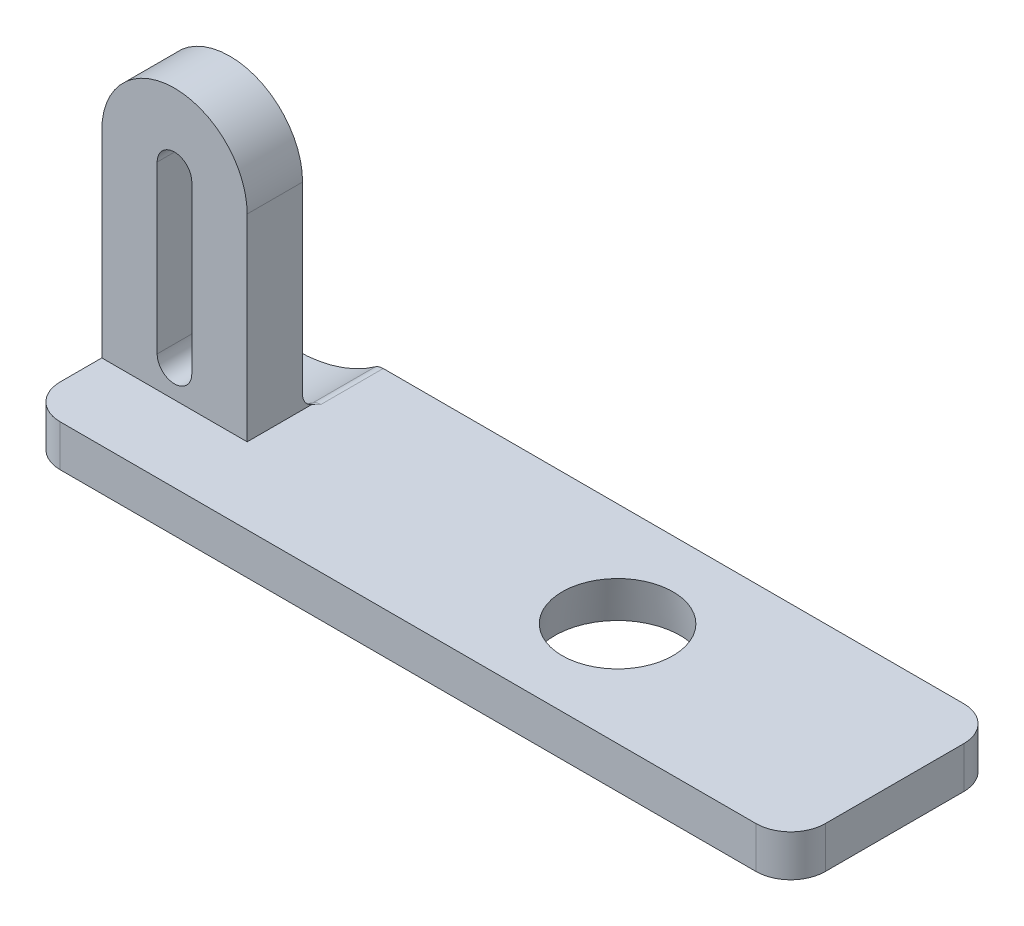
ISO-10303-21;
HEADER;
FILE_DESCRIPTION(('STEP AP214'),'2;1');
FILE_NAME('part.step','',(''),(''),'','','');
FILE_SCHEMA(('AUTOMOTIVE_DESIGN { 1 0 10303 214 1 1 1 1 }'));
ENDSEC;
DATA;
#1=APPLICATION_CONTEXT('core data for automotive mechanical design processes');
#2=APPLICATION_PROTOCOL_DEFINITION('international standard','automotive_design',2000,#1);
#3=PRODUCT_CONTEXT('',#1,'mechanical');
#4=PRODUCT('Part','Part','',(#3));
#5=PRODUCT_RELATED_PRODUCT_CATEGORY('part','',(#4));
#6=PRODUCT_DEFINITION_FORMATION('','',#4);
#7=PRODUCT_DEFINITION_CONTEXT('part definition',#1,'design');
#8=PRODUCT_DEFINITION('design','',#6,#7);
#9=PRODUCT_DEFINITION_SHAPE('','',#8);
#10=(LENGTH_UNIT() NAMED_UNIT(*) SI_UNIT(.MILLI.,.METRE.));
#11=(NAMED_UNIT(*) PLANE_ANGLE_UNIT() SI_UNIT($,.RADIAN.));
#12=(NAMED_UNIT(*) SI_UNIT($,.STERADIAN.) SOLID_ANGLE_UNIT());
#13=UNCERTAINTY_MEASURE_WITH_UNIT(LENGTH_MEASURE(1.E-05),#10,'distance_accuracy_value','');
#14=(GEOMETRIC_REPRESENTATION_CONTEXT(3) GLOBAL_UNCERTAINTY_ASSIGNED_CONTEXT((#13)) GLOBAL_UNIT_ASSIGNED_CONTEXT((#10,
#11,#12)) REPRESENTATION_CONTEXT('',''));
#15=CARTESIAN_POINT('',(0.,0.,0.));
#16=DIRECTION('',(0.,0.,1.));
#17=DIRECTION('',(1.,0.,0.));
#18=AXIS2_PLACEMENT_3D('',#15,#16,#17);
#19=CARTESIAN_POINT('',(-2.75,12.,-5.));
#20=DIRECTION('',(0.,1.,0.));
#21=DIRECTION('',(0.,0.,1.));
#22=AXIS2_PLACEMENT_3D('',#19,#20,#21);
#23=CYLINDRICAL_SURFACE('',#22,2.5);
#24=DIRECTION('',(0.,-1.,0.));
#25=VECTOR('',#24,1.);
#26=CARTESIAN_POINT('',(-5.25,-5.25,-5.));
#27=LINE('',#26,#25);
#28=CARTESIAN_POINT('',(-5.25,-4.25,-5.));
#29=VERTEX_POINT('',#28);
#30=CARTESIAN_POINT('',(-5.25,-5.25,-5.));
#31=VERTEX_POINT('',#30);
#32=EDGE_CURVE('E194',#29,#31,#27,.T.);
#33=ORIENTED_EDGE('',*,*,#32,.F.);
#34=CARTESIAN_POINT('',(-2.75,-4.25,-5.));
#35=DIRECTION('',(0.,1.,0.));
#36=DIRECTION('',(0.,0.,1.));
#37=AXIS2_PLACEMENT_3D('',#34,#35,#36);
#38=CIRCLE('',#37,2.5);
#39=CARTESIAN_POINT('',(-2.75,-4.25,-7.5));
#40=VERTEX_POINT('',#39);
#41=EDGE_CURVE('E181',#40,#29,#38,.T.);
#42=ORIENTED_EDGE('',*,*,#41,.F.);
#43=DIRECTION('',(0.,-1.,0.));
#44=VECTOR('',#43,1.);
#45=CARTESIAN_POINT('',(-2.75,-2.25,-7.5));
#46=LINE('',#45,#44);
#47=CARTESIAN_POINT('',(-2.75,-5.25,-7.5));
#48=VERTEX_POINT('',#47);
#49=EDGE_CURVE('E215',#48,#40,#46,.F.);
#50=ORIENTED_EDGE('',*,*,#49,.F.);
#51=CARTESIAN_POINT('',(-2.75,-5.25,-5.));
#52=DIRECTION('',(0.,1.,0.));
#53=DIRECTION('',(0.,0.,1.));
#54=AXIS2_PLACEMENT_3D('',#51,#52,#53);
#55=CIRCLE('',#54,2.5);
#56=EDGE_CURVE('E198',#31,#48,#55,.F.);
#57=ORIENTED_EDGE('',*,*,#56,.F.);
#58=EDGE_LOOP('',(#33,#42,#50,#57));
#59=FACE_BOUND('',#58,.T.);
#60=ADVANCED_FACE('F36',(#59),#23,.T.);
#61=CARTESIAN_POINT('',(0.,12.,7.5));
#62=DIRECTION('',(0.,0.,-1.));
#63=DIRECTION('',(-1.,0.,0.));
#64=AXIS2_PLACEMENT_3D('',#61,#62,#63);
#65=CYLINDRICAL_SURFACE('',#64,5.25);
#66=DIRECTION('',(0.,0.,-1.));
#67=VECTOR('',#66,1.);
#68=CARTESIAN_POINT('',(5.25,12.,7.5));
#69=LINE('',#68,#67);
#70=CARTESIAN_POINT('',(5.25,12.,2.));
#71=VERTEX_POINT('',#70);
#72=CARTESIAN_POINT('',(5.25,12.,-2.));
#73=VERTEX_POINT('',#72);
#74=EDGE_CURVE('E403',#71,#73,#69,.T.);
#75=ORIENTED_EDGE('',*,*,#74,.T.);
#76=CARTESIAN_POINT('',(0.,12.,-2.));
#77=DIRECTION('',(0.,0.,1.));
#78=DIRECTION('',(1.,0.,0.));
#79=AXIS2_PLACEMENT_3D('',#76,#77,#78);
#80=CIRCLE('',#79,5.25);
#81=CARTESIAN_POINT('',(-5.25,12.,-2.));
#82=VERTEX_POINT('',#81);
#83=EDGE_CURVE('E346',#82,#73,#80,.F.);
#84=ORIENTED_EDGE('',*,*,#83,.F.);
#85=DIRECTION('',(0.,0.,-1.));
#86=VECTOR('',#85,1.);
#87=CARTESIAN_POINT('',(-5.25,12.,7.5));
#88=LINE('',#87,#86);
#89=CARTESIAN_POINT('',(-5.25,12.,2.));
#90=VERTEX_POINT('',#89);
#91=EDGE_CURVE('E419',#90,#82,#88,.T.);
#92=ORIENTED_EDGE('',*,*,#91,.F.);
#93=CARTESIAN_POINT('',(0.,12.,2.));
#94=DIRECTION('',(0.,0.,1.));
#95=DIRECTION('',(1.,0.,0.));
#96=AXIS2_PLACEMENT_3D('',#93,#94,#95);
#97=CIRCLE('',#96,5.25);
#98=EDGE_CURVE('E366',#90,#71,#97,.F.);
#99=ORIENTED_EDGE('',*,*,#98,.T.);
#100=EDGE_LOOP('',(#75,#84,#92,#99));
#101=FACE_BOUND('',#100,.T.);
#102=ADVANCED_FACE('F293',(#101),#65,.T.);
#103=CARTESIAN_POINT('',(5.25,12.,7.5));
#104=DIRECTION('',(-1.,0.,0.));
#105=DIRECTION('',(0.,-1.,0.));
#106=AXIS2_PLACEMENT_3D('',#103,#104,#105);
#107=PLANE('',#106);
#108=DIRECTION('',(0.,0.,-1.));
#109=VECTOR('',#108,1.);
#110=CARTESIAN_POINT('',(5.25,-2.25,7.5));
#111=LINE('',#110,#109);
#112=CARTESIAN_POINT('',(5.25,-2.25,2.));
#113=VERTEX_POINT('',#112);
#114=CARTESIAN_POINT('',(5.25,-2.25,-2.68367330800403));
#115=VERTEX_POINT('',#114);
#116=EDGE_CURVE('E53',#113,#115,#111,.T.);
#117=ORIENTED_EDGE('',*,*,#116,.T.);
#118=CARTESIAN_POINT('',(5.25,-2.25,-2.68367330800403));
#119=CARTESIAN_POINT('',(5.25,-2.23117446991627,-2.62986567113826));
#120=CARTESIAN_POINT('',(5.25,-2.20758815592801,-2.57779088870811));
#121=CARTESIAN_POINT('',(5.25,-2.15200212125329,-2.47845496380608));
#122=CARTESIAN_POINT('',(5.25,-2.12001736194642,-2.43118546664869));
#123=CARTESIAN_POINT('',(5.25,-2.04869554314345,-2.34264234624726));
#124=CARTESIAN_POINT('',(5.25,-2.00936408325374,-2.3013641987378));
#125=CARTESIAN_POINT('',(5.25,-1.92447906424598,-2.22576847736665));
#126=CARTESIAN_POINT('',(5.25,-1.87892320484554,-2.19145348850816));
#127=CARTESIAN_POINT('',(5.25,-1.78158856659626,-2.1298977295296));
#128=CARTESIAN_POINT('',(5.25,-1.729678796793,-2.10286406490579));
#129=CARTESIAN_POINT('',(5.25,-1.62208066712606,-2.05786179627178));
#130=CARTESIAN_POINT('',(5.25,-1.56639438993115,-2.03988824117758));
#131=CARTESIAN_POINT('',(5.25,-1.4714157237039,-2.01785681894849));
#132=CARTESIAN_POINT('',(5.25,-1.43271316817472,-2.01117083172378));
#133=CARTESIAN_POINT('',(5.25,-1.35484978892017,-2.00224241638915));
#134=CARTESIAN_POINT('',(5.25,-1.31568961769241,-1.99999429159705));
#135=CARTESIAN_POINT('',(5.25,-1.27650973044174,-2.));
#136=B_SPLINE_CURVE_WITH_KNOTS('',3,(#118,#119,#120,#121,#122,#123,#124,#125,#126,#127,#128,
#129,#130,#131,#132,#133,#134,#135),.UNSPECIFIED.,.F.,.F.,(4,2,2,2,2,2,2,2,4),(0.,
0.170709651517211,0.341117232213087,0.511395455486113,0.681736777665116,0.856506568036482,
1.03118074802568,1.14877001093018,1.26620823143617),.UNSPECIFIED.);
#137=CARTESIAN_POINT('',(5.25,-1.27650973044175,-2.));
#138=VERTEX_POINT('',#137);
#139=EDGE_CURVE('E45',#115,#138,#136,.T.);
#140=ORIENTED_EDGE('',*,*,#139,.T.);
#141=DIRECTION('',(0.,-1.,0.));
#142=VECTOR('',#141,1.);
#143=CARTESIAN_POINT('',(5.25,12.,-2.));
#144=LINE('',#143,#142);
#145=EDGE_CURVE('E348',#73,#138,#144,.T.);
#146=ORIENTED_EDGE('',*,*,#145,.F.);
#147=ORIENTED_EDGE('',*,*,#74,.F.);
#148=DIRECTION('',(0.,-1.,0.));
#149=VECTOR('',#148,1.);
#150=CARTESIAN_POINT('',(5.25,-2.25,2.));
#151=LINE('',#150,#149);
#152=EDGE_CURVE('E364',#71,#113,#151,.T.);
#153=ORIENTED_EDGE('',*,*,#152,.T.);
#154=EDGE_LOOP('',(#117,#140,#146,#147,#153));
#155=FACE_BOUND('',#154,.T.);
#156=ADVANCED_FACE('F280',(#155),#107,.F.);
#157=CARTESIAN_POINT('',(0.,12.,7.5));
#158=DIRECTION('',(0.,0.,-1.));
#159=DIRECTION('',(-1.,0.,0.));
#160=AXIS2_PLACEMENT_3D('',#157,#158,#159);
#161=CYLINDRICAL_SURFACE('',#160,1.25);
#162=CARTESIAN_POINT('',(0.,12.,-2.));
#163=DIRECTION('',(0.,0.,1.));
#164=DIRECTION('',(1.,0.,0.));
#165=AXIS2_PLACEMENT_3D('',#162,#163,#164);
#166=CIRCLE('',#165,1.25);
#167=CARTESIAN_POINT('',(1.25,12.,-2.));
#168=VERTEX_POINT('',#167);
#169=CARTESIAN_POINT('',(-1.25,12.,-2.));
#170=VERTEX_POINT('',#169);
#171=EDGE_CURVE('E359',#168,#170,#166,.T.);
#172=ORIENTED_EDGE('',*,*,#171,.F.);
#173=DIRECTION('',(0.,0.,-1.));
#174=VECTOR('',#173,1.);
#175=CARTESIAN_POINT('',(1.25,12.,7.5));
#176=LINE('',#175,#174);
#177=CARTESIAN_POINT('',(1.25,12.,2.));
#178=VERTEX_POINT('',#177);
#179=EDGE_CURVE('E383',#178,#168,#176,.T.);
#180=ORIENTED_EDGE('',*,*,#179,.F.);
#181=CARTESIAN_POINT('',(0.,12.,2.));
#182=DIRECTION('',(0.,0.,1.));
#183=DIRECTION('',(1.,0.,0.));
#184=AXIS2_PLACEMENT_3D('',#181,#182,#183);
#185=CIRCLE('',#184,1.25);
#186=CARTESIAN_POINT('',(-1.25,12.,2.));
#187=VERTEX_POINT('',#186);
#188=EDGE_CURVE('E380',#178,#187,#185,.T.);
#189=ORIENTED_EDGE('',*,*,#188,.T.);
#190=DIRECTION('',(0.,0.,-1.));
#191=VECTOR('',#190,1.);
#192=CARTESIAN_POINT('',(-1.25,12.,7.5));
#193=LINE('',#192,#191);
#194=EDGE_CURVE('E392',#187,#170,#193,.T.);
#195=ORIENTED_EDGE('',*,*,#194,.T.);
#196=EDGE_LOOP('',(#172,#180,#189,#195));
#197=FACE_BOUND('',#196,.T.);
#198=ADVANCED_FACE('F430',(#197),#161,.F.);
#199=CARTESIAN_POINT('',(-1.25,12.,7.5));
#200=DIRECTION('',(1.,0.,0.));
#201=DIRECTION('',(0.,1.,0.));
#202=AXIS2_PLACEMENT_3D('',#199,#200,#201);
#203=PLANE('',#202);
#204=DIRECTION('',(0.,-1.,0.));
#205=VECTOR('',#204,1.);
#206=CARTESIAN_POINT('',(-1.25,12.,-2.));
#207=LINE('',#206,#205);
#208=CARTESIAN_POINT('',(-1.25,0.,-2.));
#209=VERTEX_POINT('',#208);
#210=EDGE_CURVE('E357',#170,#209,#207,.T.);
#211=ORIENTED_EDGE('',*,*,#210,.F.);
#212=ORIENTED_EDGE('',*,*,#194,.F.);
#213=DIRECTION('',(0.,-1.,0.));
#214=VECTOR('',#213,1.);
#215=CARTESIAN_POINT('',(-1.25,12.,2.));
#216=LINE('',#215,#214);
#217=CARTESIAN_POINT('',(-1.25,0.,2.));
#218=VERTEX_POINT('',#217);
#219=EDGE_CURVE('E377',#187,#218,#216,.T.);
#220=ORIENTED_EDGE('',*,*,#219,.T.);
#221=DIRECTION('',(0.,0.,-1.));
#222=VECTOR('',#221,1.);
#223=CARTESIAN_POINT('',(-1.25,0.,7.5));
#224=LINE('',#223,#222);
#225=EDGE_CURVE('E389',#218,#209,#224,.T.);
#226=ORIENTED_EDGE('',*,*,#225,.T.);
#227=EDGE_LOOP('',(#211,#212,#220,#226));
#228=FACE_BOUND('',#227,.T.);
#229=ADVANCED_FACE('F438',(#228),#203,.T.);
#230=CARTESIAN_POINT('',(0.,0.,7.5));
#231=DIRECTION('',(0.,0.,-1.));
#232=DIRECTION('',(-1.,0.,0.));
#233=AXIS2_PLACEMENT_3D('',#230,#231,#232);
#234=CYLINDRICAL_SURFACE('',#233,1.25);
#235=CARTESIAN_POINT('',(0.,0.,-2.));
#236=DIRECTION('',(0.,0.,1.));
#237=DIRECTION('',(1.,0.,0.));
#238=AXIS2_PLACEMENT_3D('',#235,#236,#237);
#239=CIRCLE('',#238,1.25);
#240=CARTESIAN_POINT('',(1.25,0.,-2.));
#241=VERTEX_POINT('',#240);
#242=EDGE_CURVE('E355',#209,#241,#239,.T.);
#243=ORIENTED_EDGE('',*,*,#242,.F.);
#244=ORIENTED_EDGE('',*,*,#225,.F.);
#245=CARTESIAN_POINT('',(0.,0.,2.));
#246=DIRECTION('',(0.,0.,1.));
#247=DIRECTION('',(1.,0.,0.));
#248=AXIS2_PLACEMENT_3D('',#245,#246,#247);
#249=CIRCLE('',#248,1.25);
#250=CARTESIAN_POINT('',(1.25,0.,2.));
#251=VERTEX_POINT('',#250);
#252=EDGE_CURVE('E374',#218,#251,#249,.T.);
#253=ORIENTED_EDGE('',*,*,#252,.T.);
#254=DIRECTION('',(0.,0.,-1.));
#255=VECTOR('',#254,1.);
#256=CARTESIAN_POINT('',(1.25,0.,7.5));
#257=LINE('',#256,#255);
#258=EDGE_CURVE('E386',#251,#241,#257,.T.);
#259=ORIENTED_EDGE('',*,*,#258,.T.);
#260=EDGE_LOOP('',(#243,#244,#253,#259));
#261=FACE_BOUND('',#260,.T.);
#262=ADVANCED_FACE('F441',(#261),#234,.F.);
#263=CARTESIAN_POINT('',(1.25,12.,7.5));
#264=DIRECTION('',(-1.,0.,0.));
#265=DIRECTION('',(0.,-1.,0.));
#266=AXIS2_PLACEMENT_3D('',#263,#264,#265);
#267=PLANE('',#266);
#268=DIRECTION('',(0.,1.,0.));
#269=VECTOR('',#268,1.);
#270=CARTESIAN_POINT('',(1.25,12.,-2.));
#271=LINE('',#270,#269);
#272=EDGE_CURVE('E351',#241,#168,#271,.T.);
#273=ORIENTED_EDGE('',*,*,#272,.F.);
#274=ORIENTED_EDGE('',*,*,#258,.F.);
#275=DIRECTION('',(0.,1.,0.));
#276=VECTOR('',#275,1.);
#277=CARTESIAN_POINT('',(1.25,12.,2.));
#278=LINE('',#277,#276);
#279=EDGE_CURVE('E205',#251,#178,#278,.T.);
#280=ORIENTED_EDGE('',*,*,#279,.T.);
#281=ORIENTED_EDGE('',*,*,#179,.T.);
#282=EDGE_LOOP('',(#273,#274,#280,#281));
#283=FACE_BOUND('',#282,.T.);
#284=ADVANCED_FACE('F426',(#283),#267,.T.);
#285=CARTESIAN_POINT('',(0.,12.,7.5));
#286=DIRECTION('',(0.,0.,-1.));
#287=DIRECTION('',(-1.,0.,0.));
#288=AXIS2_PLACEMENT_3D('',#285,#286,#287);
#289=PLANE('',#288);
#290=DIRECTION('',(1.,0.,0.));
#291=VECTOR('',#290,1.);
#292=CARTESIAN_POINT('',(-5.25,-5.25,7.5));
#293=LINE('',#292,#291);
#294=CARTESIAN_POINT('',(-2.75,-5.25,7.5));
#295=VERTEX_POINT('',#294);
#296=CARTESIAN_POINT('',(47.5,-5.25,7.5));
#297=VERTEX_POINT('',#296);
#298=EDGE_CURVE('E396',#295,#297,#293,.T.);
#299=ORIENTED_EDGE('',*,*,#298,.T.);
#300=DIRECTION('',(0.,1.,0.));
#301=VECTOR('',#300,1.);
#302=CARTESIAN_POINT('',(47.5,12.,7.5));
#303=LINE('',#302,#301);
#304=CARTESIAN_POINT('',(47.5,-2.25,7.5));
#305=VERTEX_POINT('',#304);
#306=EDGE_CURVE('E231',#297,#305,#303,.T.);
#307=ORIENTED_EDGE('',*,*,#306,.T.);
#308=DIRECTION('',(-1.,0.,0.));
#309=VECTOR('',#308,1.);
#310=CARTESIAN_POINT('',(5.25,-2.25,7.5));
#311=LINE('',#310,#309);
#312=CARTESIAN_POINT('',(-2.75,-2.25,7.5));
#313=VERTEX_POINT('',#312);
#314=EDGE_CURVE('E399',#305,#313,#311,.T.);
#315=ORIENTED_EDGE('',*,*,#314,.T.);
#316=DIRECTION('',(0.,-1.,0.));
#317=VECTOR('',#316,1.);
#318=CARTESIAN_POINT('',(-2.75,12.,7.5));
#319=LINE('',#318,#317);
#320=EDGE_CURVE('E228',#313,#295,#319,.T.);
#321=ORIENTED_EDGE('',*,*,#320,.T.);
#322=EDGE_LOOP('',(#299,#307,#315,#321));
#323=FACE_BOUND('',#322,.T.);
#324=ADVANCED_FACE('F468',(#323),#289,.F.);
#325=CARTESIAN_POINT('',(0.,12.,-7.5));
#326=DIRECTION('',(0.,0.,-1.));
#327=DIRECTION('',(-1.,0.,0.));
#328=AXIS2_PLACEMENT_3D('',#325,#326,#327);
#329=PLANE('',#328);
#330=CARTESIAN_POINT('',(-0.749999999999998,5.75,-7.5));
#331=DIRECTION('',(0.,0.,-1.));
#332=DIRECTION('',(-1.,0.,0.));
#333=AXIS2_PLACEMENT_3D('',#330,#331,#332);
#334=CIRCLE('',#333,10.);
#335=CARTESIAN_POINT('',(-0.749999999999998,-4.25,-7.5));
#336=VERTEX_POINT('',#335);
#337=CARTESIAN_POINT('',(4.99959574576069,-2.43181818181818,-7.5));
#338=VERTEX_POINT('',#337);
#339=EDGE_CURVE('E236',#336,#338,#334,.F.);
#340=ORIENTED_EDGE('',*,*,#339,.T.);
#341=CARTESIAN_POINT('',(5.57455532033676,-3.25,-7.5));
#342=DIRECTION('',(0.,0.,-1.));
#343=DIRECTION('',(-1.,0.,0.));
#344=AXIS2_PLACEMENT_3D('',#341,#342,#343);
#345=CIRCLE('',#344,1.);
#346=CARTESIAN_POINT('',(5.57455532033676,-2.25,-7.5));
#347=VERTEX_POINT('',#346);
#348=EDGE_CURVE('E241',#338,#347,#345,.T.);
#349=ORIENTED_EDGE('',*,*,#348,.T.);
#350=DIRECTION('',(-1.,0.,0.));
#351=VECTOR('',#350,1.);
#352=CARTESIAN_POINT('',(5.25,-2.25,-7.5));
#353=LINE('',#352,#351);
#354=CARTESIAN_POINT('',(47.5,-2.25,-7.5));
#355=VERTEX_POINT('',#354);
#356=EDGE_CURVE('E400',#355,#347,#353,.T.);
#357=ORIENTED_EDGE('',*,*,#356,.F.);
#358=DIRECTION('',(0.,1.,0.));
#359=VECTOR('',#358,1.);
#360=CARTESIAN_POINT('',(47.5,-5.25,-7.5));
#361=LINE('',#360,#359);
#362=CARTESIAN_POINT('',(47.5,-5.25,-7.5));
#363=VERTEX_POINT('',#362);
#364=EDGE_CURVE('E213',#355,#363,#361,.F.);
#365=ORIENTED_EDGE('',*,*,#364,.T.);
#366=DIRECTION('',(1.,0.,0.));
#367=VECTOR('',#366,1.);
#368=CARTESIAN_POINT('',(-5.25,-5.25,-7.5));
#369=LINE('',#368,#367);
#370=EDGE_CURVE('E395',#48,#363,#369,.T.);
#371=ORIENTED_EDGE('',*,*,#370,.F.);
#372=ORIENTED_EDGE('',*,*,#49,.T.);
#373=DIRECTION('',(-1.,0.,0.));
#374=VECTOR('',#373,1.);
#375=CARTESIAN_POINT('',(5.25,-4.25,-7.5));
#376=LINE('',#375,#374);
#377=EDGE_CURVE('E186',#336,#40,#376,.T.);
#378=ORIENTED_EDGE('',*,*,#377,.F.);
#379=EDGE_LOOP('',(#340,#349,#357,#365,#371,#372,#378));
#380=FACE_BOUND('',#379,.T.);
#381=ADVANCED_FACE('F292',(#380),#329,.T.);
#382=CARTESIAN_POINT('',(-5.25,12.,7.5));
#383=DIRECTION('',(1.,0.,0.));
#384=DIRECTION('',(0.,0.,-1.));
#385=AXIS2_PLACEMENT_3D('',#382,#383,#384);
#386=PLANE('',#385);
#387=DIRECTION('',(0.,1.,0.));
#388=VECTOR('',#387,1.);
#389=CARTESIAN_POINT('',(-5.25,12.,-2.));
#390=LINE('',#389,#388);
#391=CARTESIAN_POINT('',(-5.25,-3.25,-2.));
#392=VERTEX_POINT('',#391);
#393=EDGE_CURVE('E349',#392,#82,#390,.T.);
#394=ORIENTED_EDGE('',*,*,#393,.F.);
#395=CARTESIAN_POINT('',(-5.25,-3.25,-3.));
#396=DIRECTION('',(1.,0.,0.));
#397=DIRECTION('',(0.,0.,-1.));
#398=AXIS2_PLACEMENT_3D('',#395,#396,#397);
#399=CIRCLE('',#398,1.);
#400=CARTESIAN_POINT('',(-5.25,-4.25,-3.));
#401=VERTEX_POINT('',#400);
#402=EDGE_CURVE('E12',#392,#401,#399,.T.);
#403=ORIENTED_EDGE('',*,*,#402,.T.);
#404=DIRECTION('',(0.,0.,1.));
#405=VECTOR('',#404,1.);
#406=CARTESIAN_POINT('',(-5.25,-4.25,-2.));
#407=LINE('',#406,#405);
#408=EDGE_CURVE('E183',#29,#401,#407,.T.);
#409=ORIENTED_EDGE('',*,*,#408,.F.);
#410=ORIENTED_EDGE('',*,*,#32,.T.);
#411=DIRECTION('',(0.,0.,-1.));
#412=VECTOR('',#411,1.);
#413=CARTESIAN_POINT('',(-5.25,-5.25,7.5));
#414=LINE('',#413,#412);
#415=CARTESIAN_POINT('',(-5.25,-5.25,5.));
#416=VERTEX_POINT('',#415);
#417=EDGE_CURVE('E417',#416,#31,#414,.T.);
#418=ORIENTED_EDGE('',*,*,#417,.F.);
#419=DIRECTION('',(0.,-1.,0.));
#420=VECTOR('',#419,1.);
#421=CARTESIAN_POINT('',(-5.25,12.,5.));
#422=LINE('',#421,#420);
#423=CARTESIAN_POINT('',(-5.25,-2.25,5.));
#424=VERTEX_POINT('',#423);
#425=EDGE_CURVE('E201',#416,#424,#422,.F.);
#426=ORIENTED_EDGE('',*,*,#425,.T.);
#427=DIRECTION('',(0.,0.,1.));
#428=VECTOR('',#427,1.);
#429=CARTESIAN_POINT('',(-5.25,-2.25,-22.1472345903501));
#430=LINE('',#429,#428);
#431=CARTESIAN_POINT('',(-5.25,-2.25,2.));
#432=VERTEX_POINT('',#431);
#433=EDGE_CURVE('E361',#432,#424,#430,.T.);
#434=ORIENTED_EDGE('',*,*,#433,.F.);
#435=DIRECTION('',(0.,1.,0.));
#436=VECTOR('',#435,1.);
#437=CARTESIAN_POINT('',(-5.25,12.,2.));
#438=LINE('',#437,#436);
#439=EDGE_CURVE('E369',#432,#90,#438,.T.);
#440=ORIENTED_EDGE('',*,*,#439,.T.);
#441=ORIENTED_EDGE('',*,*,#91,.T.);
#442=EDGE_LOOP('',(#394,#403,#409,#410,#418,#426,#434,#440,#441));
#443=FACE_BOUND('',#442,.T.);
#444=ADVANCED_FACE('F192',(#443),#386,.F.);
#445=CARTESIAN_POINT('',(-5.25,-5.25,7.5));
#446=DIRECTION('',(0.,1.,0.));
#447=DIRECTION('',(0.,0.,1.));
#448=AXIS2_PLACEMENT_3D('',#445,#446,#447);
#449=PLANE('',#448);
#450=CARTESIAN_POINT('',(30.,-5.25,0.));
#451=DIRECTION('',(0.,1.,0.));
#452=DIRECTION('',(0.,0.,1.));
#453=AXIS2_PLACEMENT_3D('',#450,#451,#452);
#454=CIRCLE('',#453,4.5289809421254);
#455=CARTESIAN_POINT('',(30.,-5.25,4.5289809421254));
#456=VERTEX_POINT('',#455);
#457=EDGE_CURVE('E343',#456,#456,#454,.T.);
#458=ORIENTED_EDGE('',*,*,#457,.T.);
#459=EDGE_LOOP('',(#458));
#460=FACE_BOUND('',#459,.T.);
#461=ORIENTED_EDGE('',*,*,#417,.T.);
#462=ORIENTED_EDGE('',*,*,#56,.T.);
#463=ORIENTED_EDGE('',*,*,#370,.T.);
#464=CARTESIAN_POINT('',(47.5,-5.25,-5.));
#465=DIRECTION('',(0.,1.,0.));
#466=DIRECTION('',(0.,0.,1.));
#467=AXIS2_PLACEMENT_3D('',#464,#465,#466);
#468=CIRCLE('',#467,2.5);
#469=CARTESIAN_POINT('',(50.,-5.25,-5.));
#470=VERTEX_POINT('',#469);
#471=EDGE_CURVE('E210',#363,#470,#468,.F.);
#472=ORIENTED_EDGE('',*,*,#471,.T.);
#473=DIRECTION('',(0.,0.,-1.));
#474=VECTOR('',#473,1.);
#475=CARTESIAN_POINT('',(50.,-5.25,7.5));
#476=LINE('',#475,#474);
#477=CARTESIAN_POINT('',(50.,-5.25,5.));
#478=VERTEX_POINT('',#477);
#479=EDGE_CURVE('E414',#478,#470,#476,.T.);
#480=ORIENTED_EDGE('',*,*,#479,.F.);
#481=CARTESIAN_POINT('',(47.5,-5.25,5.));
#482=DIRECTION('',(0.,1.,0.));
#483=DIRECTION('',(0.,0.,1.));
#484=AXIS2_PLACEMENT_3D('',#481,#482,#483);
#485=CIRCLE('',#484,2.5);
#486=EDGE_CURVE('E203',#478,#297,#485,.F.);
#487=ORIENTED_EDGE('',*,*,#486,.T.);
#488=ORIENTED_EDGE('',*,*,#298,.F.);
#489=CARTESIAN_POINT('',(-2.75,-5.25,5.));
#490=DIRECTION('',(0.,1.,0.));
#491=DIRECTION('',(0.,0.,1.));
#492=AXIS2_PLACEMENT_3D('',#489,#490,#491);
#493=CIRCLE('',#492,2.5);
#494=EDGE_CURVE('E200',#295,#416,#493,.F.);
#495=ORIENTED_EDGE('',*,*,#494,.T.);
#496=EDGE_LOOP('',(#461,#462,#463,#472,#480,#487,#488,#495));
#497=FACE_BOUND('',#496,.T.);
#498=ADVANCED_FACE('F285',(#460,#497),#449,.F.);
#499=CARTESIAN_POINT('',(50.,-2.25,7.5));
#500=DIRECTION('',(-1.,0.,0.));
#501=DIRECTION('',(0.,0.,1.));
#502=AXIS2_PLACEMENT_3D('',#499,#500,#501);
#503=PLANE('',#502);
#504=ORIENTED_EDGE('',*,*,#479,.T.);
#505=DIRECTION('',(0.,1.,0.));
#506=VECTOR('',#505,1.);
#507=CARTESIAN_POINT('',(50.,-2.25,-5.));
#508=LINE('',#507,#506);
#509=CARTESIAN_POINT('',(50.,-2.25,-5.));
#510=VERTEX_POINT('',#509);
#511=EDGE_CURVE('E225',#470,#510,#508,.T.);
#512=ORIENTED_EDGE('',*,*,#511,.T.);
#513=DIRECTION('',(0.,0.,-1.));
#514=VECTOR('',#513,1.);
#515=CARTESIAN_POINT('',(50.,-2.25,7.5));
#516=LINE('',#515,#514);
#517=CARTESIAN_POINT('',(50.,-2.25,5.));
#518=VERTEX_POINT('',#517);
#519=EDGE_CURVE('E411',#518,#510,#516,.T.);
#520=ORIENTED_EDGE('',*,*,#519,.F.);
#521=DIRECTION('',(0.,1.,0.));
#522=VECTOR('',#521,1.);
#523=CARTESIAN_POINT('',(50.,-2.25,5.));
#524=LINE('',#523,#522);
#525=EDGE_CURVE('E223',#518,#478,#524,.F.);
#526=ORIENTED_EDGE('',*,*,#525,.T.);
#527=EDGE_LOOP('',(#504,#512,#520,#526));
#528=FACE_BOUND('',#527,.T.);
#529=ADVANCED_FACE('F278',(#528),#503,.F.);
#530=CARTESIAN_POINT('',(5.25,-2.25,7.5));
#531=DIRECTION('',(0.,-1.,0.));
#532=DIRECTION('',(0.,0.,-1.));
#533=AXIS2_PLACEMENT_3D('',#530,#531,#532);
#534=PLANE('',#533);
#535=CARTESIAN_POINT('',(30.,-2.25,0.));
#536=DIRECTION('',(0.,1.,0.));
#537=DIRECTION('',(0.,0.,1.));
#538=AXIS2_PLACEMENT_3D('',#535,#536,#537);
#539=CIRCLE('',#538,4.00000000000001);
#540=CARTESIAN_POINT('',(30.,-2.25,4.00000000000001));
#541=VERTEX_POINT('',#540);
#542=EDGE_CURVE('E196',#541,#541,#539,.T.);
#543=ORIENTED_EDGE('',*,*,#542,.F.);
#544=EDGE_LOOP('',(#543));
#545=FACE_BOUND('',#544,.T.);
#546=ORIENTED_EDGE('',*,*,#356,.T.);
#547=DIRECTION('',(0.,0.,-1.));
#548=VECTOR('',#547,1.);
#549=CARTESIAN_POINT('',(5.57455532033676,-2.25,7.5));
#550=LINE('',#549,#548);
#551=CARTESIAN_POINT('',(5.57455532033676,-2.25,-3.));
#552=VERTEX_POINT('',#551);
#553=EDGE_CURVE('E243',#347,#552,#550,.F.);
#554=ORIENTED_EDGE('',*,*,#553,.T.);
#555=CARTESIAN_POINT('',(5.25,-2.25,-2.68367330800403));
#556=CARTESIAN_POINT('',(5.30467382771404,-2.24999999999999,-2.73429007344327));
#557=CARTESIAN_POINT('',(5.35836343553421,-2.24999999999999,-2.78592292147372));
#558=CARTESIAN_POINT('',(5.46473523839905,-2.25000000000001,-2.8902094724383));
#559=CARTESIAN_POINT('',(5.51741755662603,-2.25000000000002,-2.94286304894004));
#560=CARTESIAN_POINT('',(5.57157389866178,-2.25,-2.99701857824215));
#561=CARTESIAN_POINT('',(5.57306461070622,-2.25,-2.99850929030965));
#562=CARTESIAN_POINT('',(5.57455532033676,-2.25,-3.));
#563=B_SPLINE_CURVE_WITH_KNOTS('',3,(#555,#556,#557,#558,#559,#560,#561,#562),.UNSPECIFIED.,.F.,
.F.,(4,2,2,4),(0.,0.223466778332691,0.446906051639364,0.453230606961699),.UNSPECIFIED.);
#564=EDGE_CURVE('E259',#552,#115,#563,.F.);
#565=ORIENTED_EDGE('',*,*,#564,.T.);
#566=ORIENTED_EDGE('',*,*,#116,.F.);
#567=DIRECTION('',(-1.,0.,0.));
#568=VECTOR('',#567,1.);
#569=CARTESIAN_POINT('',(5.25,-2.25,2.));
#570=LINE('',#569,#568);
#571=EDGE_CURVE('E362',#113,#432,#570,.T.);
#572=ORIENTED_EDGE('',*,*,#571,.T.);
#573=ORIENTED_EDGE('',*,*,#433,.T.);
#574=CARTESIAN_POINT('',(-2.75,-2.25,5.));
#575=DIRECTION('',(0.,-1.,0.));
#576=DIRECTION('',(0.,0.,-1.));
#577=AXIS2_PLACEMENT_3D('',#574,#575,#576);
#578=CIRCLE('',#577,2.5);
#579=EDGE_CURVE('E217',#424,#313,#578,.F.);
#580=ORIENTED_EDGE('',*,*,#579,.T.);
#581=ORIENTED_EDGE('',*,*,#314,.F.);
#582=CARTESIAN_POINT('',(47.5,-2.25,5.));
#583=DIRECTION('',(0.,-1.,0.));
#584=DIRECTION('',(0.,0.,-1.));
#585=AXIS2_PLACEMENT_3D('',#582,#583,#584);
#586=CIRCLE('',#585,2.5);
#587=EDGE_CURVE('E219',#305,#518,#586,.F.);
#588=ORIENTED_EDGE('',*,*,#587,.T.);
#589=ORIENTED_EDGE('',*,*,#519,.T.);
#590=CARTESIAN_POINT('',(47.5,-2.25,-5.));
#591=DIRECTION('',(0.,-1.,0.));
#592=DIRECTION('',(0.,0.,-1.));
#593=AXIS2_PLACEMENT_3D('',#590,#591,#592);
#594=CIRCLE('',#593,2.5);
#595=EDGE_CURVE('E221',#510,#355,#594,.F.);
#596=ORIENTED_EDGE('',*,*,#595,.T.);
#597=EDGE_LOOP('',(#546,#554,#565,#566,#572,#573,#580,#581,#588,#589,#596));
#598=FACE_BOUND('',#597,.T.);
#599=ADVANCED_FACE('F273',(#545,#598),#534,.F.);
#600=CARTESIAN_POINT('',(0.,0.,2.));
#601=DIRECTION('',(0.,0.,1.));
#602=DIRECTION('',(1.,0.,0.));
#603=AXIS2_PLACEMENT_3D('',#600,#601,#602);
#604=PLANE('',#603);
#605=ORIENTED_EDGE('',*,*,#279,.F.);
#606=ORIENTED_EDGE('',*,*,#252,.F.);
#607=ORIENTED_EDGE('',*,*,#219,.F.);
#608=ORIENTED_EDGE('',*,*,#188,.F.);
#609=EDGE_LOOP('',(#605,#606,#607,#608));
#610=FACE_BOUND('',#609,.T.);
#611=ORIENTED_EDGE('',*,*,#98,.F.);
#612=ORIENTED_EDGE('',*,*,#439,.F.);
#613=ORIENTED_EDGE('',*,*,#571,.F.);
#614=ORIENTED_EDGE('',*,*,#152,.F.);
#615=EDGE_LOOP('',(#611,#612,#613,#614));
#616=FACE_BOUND('',#615,.T.);
#617=ADVANCED_FACE('F277',(#610,#616),#604,.T.);
#618=CARTESIAN_POINT('',(0.,0.,-2.));
#619=DIRECTION('',(0.,0.,1.));
#620=DIRECTION('',(1.,0.,0.));
#621=AXIS2_PLACEMENT_3D('',#618,#619,#620);
#622=PLANE('',#621);
#623=ORIENTED_EDGE('',*,*,#171,.T.);
#624=ORIENTED_EDGE('',*,*,#210,.T.);
#625=ORIENTED_EDGE('',*,*,#242,.T.);
#626=ORIENTED_EDGE('',*,*,#272,.T.);
#627=EDGE_LOOP('',(#623,#624,#625,#626));
#628=FACE_BOUND('',#627,.T.);
#629=ORIENTED_EDGE('',*,*,#145,.T.);
#630=CARTESIAN_POINT('',(5.57455532033676,-3.25,-2.));
#631=DIRECTION('',(0.,0.,1.));
#632=DIRECTION('',(1.,0.,0.));
#633=AXIS2_PLACEMENT_3D('',#630,#631,#632);
#634=CIRCLE('',#633,2.);
#635=CARTESIAN_POINT('',(4.42463617118462,-1.61363636363636,-2.));
#636=VERTEX_POINT('',#635);
#637=EDGE_CURVE('E250',#138,#636,#634,.T.);
#638=ORIENTED_EDGE('',*,*,#637,.T.);
#639=CARTESIAN_POINT('',(-0.749999999999999,5.75,-2.));
#640=DIRECTION('',(0.,0.,1.));
#641=DIRECTION('',(1.,0.,0.));
#642=AXIS2_PLACEMENT_3D('',#639,#640,#641);
#643=CIRCLE('',#642,9.);
#644=CARTESIAN_POINT('',(-0.749999999999999,-3.25,-2.));
#645=VERTEX_POINT('',#644);
#646=EDGE_CURVE('E248',#636,#645,#643,.F.);
#647=ORIENTED_EDGE('',*,*,#646,.T.);
#648=DIRECTION('',(1.,0.,0.));
#649=VECTOR('',#648,1.);
#650=CARTESIAN_POINT('',(0.,-3.25,-2.));
#651=LINE('',#650,#649);
#652=EDGE_CURVE('E246',#645,#392,#651,.F.);
#653=ORIENTED_EDGE('',*,*,#652,.T.);
#654=ORIENTED_EDGE('',*,*,#393,.T.);
#655=ORIENTED_EDGE('',*,*,#83,.T.);
#656=EDGE_LOOP('',(#629,#638,#647,#653,#654,#655));
#657=FACE_BOUND('',#656,.T.);
#658=ADVANCED_FACE('F434',(#628,#657),#622,.F.);
#659=CARTESIAN_POINT('',(30.,-2.25,0.));
#660=DIRECTION('',(0.,-1.,0.));
#661=DIRECTION('',(0.,0.,1.));
#662=AXIS2_PLACEMENT_3D('',#659,#660,#661);
#663=CONICAL_SURFACE('',#662,4.00000000000001,0.174532925199433);
#664=ORIENTED_EDGE('',*,*,#457,.F.);
#665=EDGE_LOOP('',(#664));
#666=FACE_BOUND('',#665,.T.);
#667=ORIENTED_EDGE('',*,*,#542,.T.);
#668=EDGE_LOOP('',(#667));
#669=FACE_BOUND('',#668,.T.);
#670=ADVANCED_FACE('F303',(#666,#669),#663,.F.);
#671=CARTESIAN_POINT('',(47.5,-2.25,-5.));
#672=DIRECTION('',(0.,-1.,0.));
#673=DIRECTION('',(0.,0.,-1.));
#674=AXIS2_PLACEMENT_3D('',#671,#672,#673);
#675=CYLINDRICAL_SURFACE('',#674,2.5);
#676=ORIENTED_EDGE('',*,*,#471,.F.);
#677=ORIENTED_EDGE('',*,*,#364,.F.);
#678=ORIENTED_EDGE('',*,*,#595,.F.);
#679=ORIENTED_EDGE('',*,*,#511,.F.);
#680=EDGE_LOOP('',(#676,#677,#678,#679));
#681=FACE_BOUND('',#680,.T.);
#682=ADVANCED_FACE('F299',(#681),#675,.T.);
#683=CARTESIAN_POINT('',(47.5,12.,5.));
#684=DIRECTION('',(0.,1.,0.));
#685=DIRECTION('',(0.,0.,1.));
#686=AXIS2_PLACEMENT_3D('',#683,#684,#685);
#687=CYLINDRICAL_SURFACE('',#686,2.5);
#688=ORIENTED_EDGE('',*,*,#486,.F.);
#689=ORIENTED_EDGE('',*,*,#525,.F.);
#690=ORIENTED_EDGE('',*,*,#587,.F.);
#691=ORIENTED_EDGE('',*,*,#306,.F.);
#692=EDGE_LOOP('',(#688,#689,#690,#691));
#693=FACE_BOUND('',#692,.T.);
#694=ADVANCED_FACE('F302',(#693),#687,.T.);
#695=CARTESIAN_POINT('',(-2.75,12.,5.));
#696=DIRECTION('',(0.,-1.,0.));
#697=DIRECTION('',(0.,0.,-1.));
#698=AXIS2_PLACEMENT_3D('',#695,#696,#697);
#699=CYLINDRICAL_SURFACE('',#698,2.5);
#700=ORIENTED_EDGE('',*,*,#579,.F.);
#701=ORIENTED_EDGE('',*,*,#425,.F.);
#702=ORIENTED_EDGE('',*,*,#494,.F.);
#703=ORIENTED_EDGE('',*,*,#320,.F.);
#704=EDGE_LOOP('',(#700,#701,#702,#703));
#705=FACE_BOUND('',#704,.T.);
#706=ADVANCED_FACE('F307',(#705),#699,.T.);
#707=CARTESIAN_POINT('',(-2.75,-4.25,-5.));
#708=DIRECTION('',(0.,1.,0.));
#709=DIRECTION('',(0.,0.,1.));
#710=AXIS2_PLACEMENT_3D('',#707,#708,#709);
#711=PLANE('',#710);
#712=ORIENTED_EDGE('',*,*,#408,.T.);
#713=DIRECTION('',(1.,0.,0.));
#714=VECTOR('',#713,1.);
#715=CARTESIAN_POINT('',(-2.75,-4.25,-3.));
#716=LINE('',#715,#714);
#717=CARTESIAN_POINT('',(-0.749999999999999,-4.25,-3.));
#718=VERTEX_POINT('',#717);
#719=EDGE_CURVE('E257',#401,#718,#716,.T.);
#720=ORIENTED_EDGE('',*,*,#719,.T.);
#721=DIRECTION('',(0.,0.,1.));
#722=VECTOR('',#721,1.);
#723=CARTESIAN_POINT('',(-0.749999999999998,-4.25,-7.5));
#724=LINE('',#723,#722);
#725=EDGE_CURVE('E234',#718,#336,#724,.F.);
#726=ORIENTED_EDGE('',*,*,#725,.T.);
#727=ORIENTED_EDGE('',*,*,#377,.T.);
#728=ORIENTED_EDGE('',*,*,#41,.T.);
#729=EDGE_LOOP('',(#712,#720,#726,#727,#728));
#730=FACE_BOUND('',#729,.T.);
#731=ADVANCED_FACE('F182',(#730),#711,.T.);
#732=CARTESIAN_POINT('',(-0.75,5.75,-2.));
#733=DIRECTION('',(0.,0.,-1.));
#734=DIRECTION('',(-1.,0.,0.));
#735=AXIS2_PLACEMENT_3D('',#732,#733,#734);
#736=CYLINDRICAL_SURFACE('',#735,10.);
#737=ORIENTED_EDGE('',*,*,#725,.F.);
#738=CARTESIAN_POINT('',(-0.749999999999999,5.75,-3.));
#739=DIRECTION('',(0.,0.,1.));
#740=DIRECTION('',(1.,0.,0.));
#741=AXIS2_PLACEMENT_3D('',#738,#739,#740);
#742=CIRCLE('',#741,10.);
#743=CARTESIAN_POINT('',(4.99959574576069,-2.43181818181818,-3.));
#744=VERTEX_POINT('',#743);
#745=EDGE_CURVE('E255',#718,#744,#742,.T.);
#746=ORIENTED_EDGE('',*,*,#745,.T.);
#747=DIRECTION('',(0.,0.,-1.));
#748=VECTOR('',#747,1.);
#749=CARTESIAN_POINT('',(4.99959574576069,-2.43181818181818,-2.));
#750=LINE('',#749,#748);
#751=EDGE_CURVE('E239',#744,#338,#750,.T.);
#752=ORIENTED_EDGE('',*,*,#751,.T.);
#753=ORIENTED_EDGE('',*,*,#339,.F.);
#754=EDGE_LOOP('',(#737,#746,#752,#753));
#755=FACE_BOUND('',#754,.T.);
#756=ADVANCED_FACE('F312',(#755),#736,.F.);
#757=CARTESIAN_POINT('',(5.57455532033676,-3.25,-2.));
#758=DIRECTION('',(0.,0.,-1.));
#759=DIRECTION('',(-1.,0.,0.));
#760=AXIS2_PLACEMENT_3D('',#757,#758,#759);
#761=CYLINDRICAL_SURFACE('',#760,1.);
#762=ORIENTED_EDGE('',*,*,#751,.F.);
#763=CARTESIAN_POINT('',(5.57455532033676,-3.25,-3.));
#764=DIRECTION('',(0.,0.,1.));
#765=DIRECTION('',(1.,0.,0.));
#766=AXIS2_PLACEMENT_3D('',#763,#764,#765);
#767=CIRCLE('',#766,1.);
#768=EDGE_CURVE('E253',#744,#552,#767,.F.);
#769=ORIENTED_EDGE('',*,*,#768,.T.);
#770=ORIENTED_EDGE('',*,*,#553,.F.);
#771=ORIENTED_EDGE('',*,*,#348,.F.);
#772=EDGE_LOOP('',(#762,#769,#770,#771));
#773=FACE_BOUND('',#772,.T.);
#774=ADVANCED_FACE('F314',(#773),#761,.T.);
#775=CARTESIAN_POINT('',(-2.75,-3.25,-3.));
#776=DIRECTION('',(1.,0.,0.));
#777=DIRECTION('',(0.,0.,-1.));
#778=AXIS2_PLACEMENT_3D('',#775,#776,#777);
#779=CYLINDRICAL_SURFACE('',#778,1.);
#780=ORIENTED_EDGE('',*,*,#402,.F.);
#781=ORIENTED_EDGE('',*,*,#652,.F.);
#782=CARTESIAN_POINT('',(-0.749999999999999,-3.25,-3.));
#783=DIRECTION('',(-1.,0.,0.));
#784=DIRECTION('',(0.,0.,1.));
#785=AXIS2_PLACEMENT_3D('',#782,#783,#784);
#786=CIRCLE('',#785,1.);
#787=EDGE_CURVE('E40',#718,#645,#786,.T.);
#788=ORIENTED_EDGE('',*,*,#787,.F.);
#789=ORIENTED_EDGE('',*,*,#719,.F.);
#790=EDGE_LOOP('',(#780,#781,#788,#789));
#791=FACE_BOUND('',#790,.T.);
#792=ADVANCED_FACE('F38',(#791),#779,.F.);
#793=CARTESIAN_POINT('',(-0.749999999999999,5.75,-3.));
#794=DIRECTION('',(0.,0.,1.));
#795=DIRECTION('',(1.,0.,0.));
#796=AXIS2_PLACEMENT_3D('',#793,#794,#795);
#797=TOROIDAL_SURFACE('',#796,9.,1.);
#798=ORIENTED_EDGE('',*,*,#787,.T.);
#799=ORIENTED_EDGE('',*,*,#646,.F.);
#800=CARTESIAN_POINT('',(4.42463617118462,-1.61363636363636,-3.));
#801=DIRECTION('',(-0.818181818181818,-0.574959574576069,0.));
#802=DIRECTION('',(0.574959574576069,-0.818181818181818,0.));
#803=AXIS2_PLACEMENT_3D('',#800,#801,#802);
#804=CIRCLE('',#803,1.);
#805=EDGE_CURVE('E332',#744,#636,#804,.T.);
#806=ORIENTED_EDGE('',*,*,#805,.F.);
#807=ORIENTED_EDGE('',*,*,#745,.F.);
#808=EDGE_LOOP('',(#798,#799,#806,#807));
#809=FACE_BOUND('',#808,.T.);
#810=ADVANCED_FACE('F321',(#809),#797,.F.);
#811=CARTESIAN_POINT('',(5.57455532033676,-3.25,-3.));
#812=DIRECTION('',(0.,0.,1.));
#813=DIRECTION('',(1.,0.,0.));
#814=AXIS2_PLACEMENT_3D('',#811,#812,#813);
#815=TOROIDAL_SURFACE('',#814,2.,1.);
#816=ORIENTED_EDGE('',*,*,#564,.F.);
#817=ORIENTED_EDGE('',*,*,#768,.F.);
#818=ORIENTED_EDGE('',*,*,#805,.T.);
#819=ORIENTED_EDGE('',*,*,#637,.F.);
#820=ORIENTED_EDGE('',*,*,#139,.F.);
#821=EDGE_LOOP('',(#816,#817,#818,#819,#820));
#822=FACE_BOUND('',#821,.T.);
#823=ADVANCED_FACE('F270',(#822),#815,.F.);
#824=CLOSED_SHELL('',(#60,#102,#156,#198,#229,#262,#284,#324,#381,#444,#498,#529,#599,#617,#658,
#670,#682,#694,#706,#731,#756,#774,#792,#810,#823));
#825=MANIFOLD_SOLID_BREP('B2',#824);
#826=ADVANCED_BREP_SHAPE_REPRESENTATION('',(#18,#825),#14);
#827=SHAPE_DEFINITION_REPRESENTATION(#9,#826);
ENDSEC;
END-ISO-10303-21;
